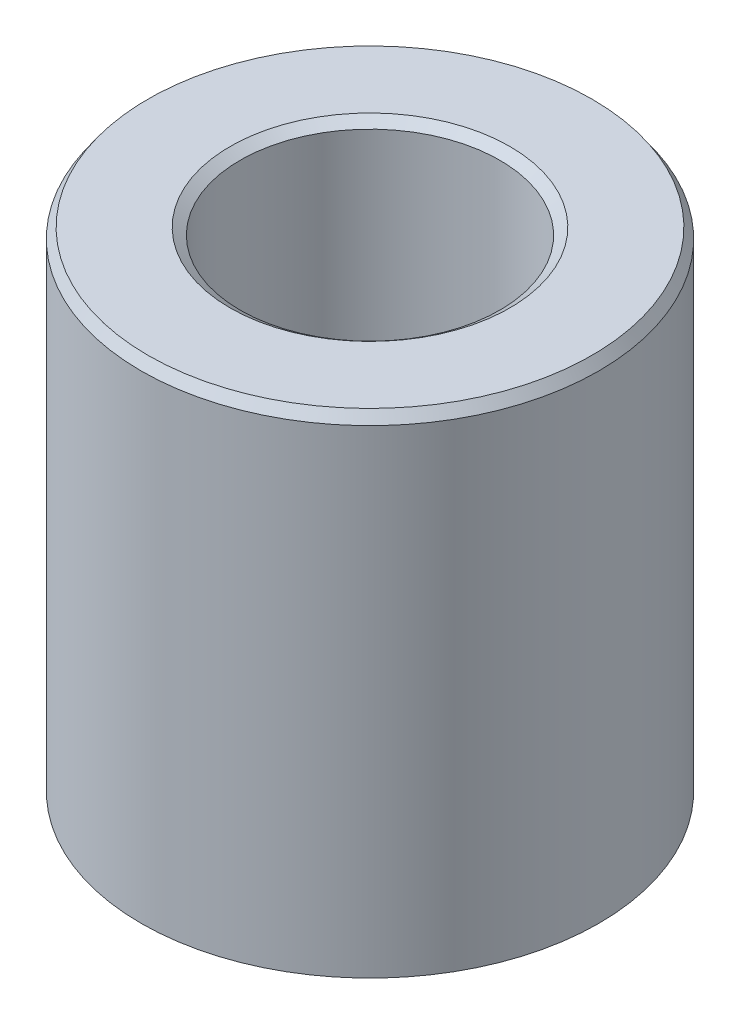
ISO-10303-21;
HEADER;
FILE_DESCRIPTION(('STEP AP214'),'2;1');
FILE_NAME('part.step','',(''),(''),'','','');
FILE_SCHEMA(('AUTOMOTIVE_DESIGN { 1 0 10303 214 1 1 1 1 }'));
ENDSEC;
DATA;
#1=APPLICATION_CONTEXT('core data for automotive mechanical design processes');
#2=APPLICATION_PROTOCOL_DEFINITION('international standard','automotive_design',2000,#1);
#3=PRODUCT_CONTEXT('',#1,'mechanical');
#4=PRODUCT('Part','Part','',(#3));
#5=PRODUCT_RELATED_PRODUCT_CATEGORY('part','',(#4));
#6=PRODUCT_DEFINITION_FORMATION('','',#4);
#7=PRODUCT_DEFINITION_CONTEXT('part definition',#1,'design');
#8=PRODUCT_DEFINITION('design','',#6,#7);
#9=PRODUCT_DEFINITION_SHAPE('','',#8);
#10=(LENGTH_UNIT() NAMED_UNIT(*) SI_UNIT(.MILLI.,.METRE.));
#11=(NAMED_UNIT(*) PLANE_ANGLE_UNIT() SI_UNIT($,.RADIAN.));
#12=(NAMED_UNIT(*) SI_UNIT($,.STERADIAN.) SOLID_ANGLE_UNIT());
#13=UNCERTAINTY_MEASURE_WITH_UNIT(LENGTH_MEASURE(1.E-05),#10,'distance_accuracy_value','');
#14=(GEOMETRIC_REPRESENTATION_CONTEXT(3) GLOBAL_UNCERTAINTY_ASSIGNED_CONTEXT((#13)) GLOBAL_UNIT_ASSIGNED_CONTEXT((#10,
#11,#12)) REPRESENTATION_CONTEXT('',''));
#15=CARTESIAN_POINT('',(0.,0.,0.));
#16=DIRECTION('',(0.,0.,1.));
#17=DIRECTION('',(1.,0.,0.));
#18=AXIS2_PLACEMENT_3D('',#15,#16,#17);
#19=CARTESIAN_POINT('',(0.,129.861566175015,0.));
#20=DIRECTION('',(0.,-1.,0.));
#21=DIRECTION('',(0.,0.,-1.));
#22=AXIS2_PLACEMENT_3D('',#19,#20,#21);
#23=CYLINDRICAL_SURFACE('',#22,60.);
#24=CARTESIAN_POINT('',(0.,1.81117595208058,0.));
#25=DIRECTION('',(0.,1.,0.));
#26=DIRECTION('',(0.,0.,1.));
#27=AXIS2_PLACEMENT_3D('',#24,#25,#26);
#28=CIRCLE('',#27,60.);
#29=CARTESIAN_POINT('',(0.,1.81117595208058,60.));
#30=VERTEX_POINT('',#29);
#31=EDGE_CURVE('E10',#30,#30,#28,.T.);
#32=ORIENTED_EDGE('',*,*,#31,.T.);
#33=EDGE_LOOP('',(#32));
#34=FACE_BOUND('',#33,.T.);
#35=CARTESIAN_POINT('',(0.,127.233057292651,0.));
#36=DIRECTION('',(0.,1.,0.));
#37=DIRECTION('',(0.,0.,1.));
#38=AXIS2_PLACEMENT_3D('',#35,#36,#37);
#39=CIRCLE('',#38,60.);
#40=CARTESIAN_POINT('',(0.,127.233057292651,60.));
#41=VERTEX_POINT('',#40);
#42=EDGE_CURVE('E50',#41,#41,#39,.F.);
#43=ORIENTED_EDGE('',*,*,#42,.T.);
#44=EDGE_LOOP('',(#43));
#45=FACE_BOUND('',#44,.T.);
#46=ADVANCED_FACE('F39',(#34,#45),#23,.T.);
#47=CARTESIAN_POINT('',(0.,129.861566175015,0.));
#48=DIRECTION('',(0.,1.,0.));
#49=DIRECTION('',(0.,0.,1.));
#50=AXIS2_PLACEMENT_3D('',#47,#48,#49);
#51=PLANE('',#50);
#52=CARTESIAN_POINT('',(0.,129.861566175015,0.));
#53=DIRECTION('',(0.,1.,0.));
#54=DIRECTION('',(0.,0.,1.));
#55=AXIS2_PLACEMENT_3D('',#52,#53,#54);
#56=CIRCLE('',#55,36.6722442143869);
#57=CARTESIAN_POINT('',(0.,129.861566175015,36.6722442143869));
#58=VERTEX_POINT('',#57);
#59=EDGE_CURVE('E58',#58,#58,#56,.F.);
#60=ORIENTED_EDGE('',*,*,#59,.T.);
#61=EDGE_LOOP('',(#60));
#62=FACE_BOUND('',#61,.T.);
#63=CARTESIAN_POINT('',(0.,129.861566175015,0.));
#64=DIRECTION('',(0.,1.,0.));
#65=DIRECTION('',(0.,0.,1.));
#66=AXIS2_PLACEMENT_3D('',#63,#64,#65);
#67=CIRCLE('',#66,58.1888240479194);
#68=CARTESIAN_POINT('',(0.,129.861566175015,58.1888240479194));
#69=VERTEX_POINT('',#68);
#70=EDGE_CURVE('E61',#69,#69,#67,.T.);
#71=ORIENTED_EDGE('',*,*,#70,.T.);
#72=EDGE_LOOP('',(#71));
#73=FACE_BOUND('',#72,.T.);
#74=ADVANCED_FACE('F88',(#62,#73),#51,.T.);
#75=CARTESIAN_POINT('',(0.,0.,0.));
#76=DIRECTION('',(0.,1.,0.));
#77=DIRECTION('',(0.,0.,1.));
#78=AXIS2_PLACEMENT_3D('',#75,#76,#77);
#79=PLANE('',#78);
#80=CARTESIAN_POINT('',(0.,0.,0.));
#81=DIRECTION('',(0.,1.,0.));
#82=DIRECTION('',(0.,0.,1.));
#83=AXIS2_PLACEMENT_3D('',#80,#81,#82);
#84=CIRCLE('',#83,35.8549112841044);
#85=CARTESIAN_POINT('',(0.,0.,35.8549112841044));
#86=VERTEX_POINT('',#85);
#87=EDGE_CURVE('E51',#86,#86,#84,.T.);
#88=ORIENTED_EDGE('',*,*,#87,.T.);
#89=EDGE_LOOP('',(#88));
#90=FACE_BOUND('',#89,.T.);
#91=CARTESIAN_POINT('',(0.,0.,0.));
#92=DIRECTION('',(0.,1.,0.));
#93=DIRECTION('',(0.,0.,1.));
#94=AXIS2_PLACEMENT_3D('',#91,#92,#93);
#95=CIRCLE('',#94,57.3714911176369);
#96=CARTESIAN_POINT('',(0.,0.,57.3714911176369));
#97=VERTEX_POINT('',#96);
#98=EDGE_CURVE('E54',#97,#97,#95,.F.);
#99=ORIENTED_EDGE('',*,*,#98,.T.);
#100=EDGE_LOOP('',(#99));
#101=FACE_BOUND('',#100,.T.);
#102=ADVANCED_FACE('F83',(#90,#101),#79,.F.);
#103=CARTESIAN_POINT('',(0.,129.861566175015,0.));
#104=DIRECTION('',(0.,-1.,0.));
#105=DIRECTION('',(0.,0.,-1.));
#106=AXIS2_PLACEMENT_3D('',#103,#104,#105);
#107=CYLINDRICAL_SURFACE('',#106,34.0437353320238);
#108=CARTESIAN_POINT('',(0.,128.050390222934,0.));
#109=DIRECTION('',(0.,1.,0.));
#110=DIRECTION('',(0.,0.,1.));
#111=AXIS2_PLACEMENT_3D('',#108,#109,#110);
#112=CIRCLE('',#111,34.0437353320238);
#113=CARTESIAN_POINT('',(0.,128.050390222934,34.0437353320238));
#114=VERTEX_POINT('',#113);
#115=EDGE_CURVE('E67',#114,#114,#112,.T.);
#116=ORIENTED_EDGE('',*,*,#115,.T.);
#117=EDGE_LOOP('',(#116));
#118=FACE_BOUND('',#117,.T.);
#119=CARTESIAN_POINT('',(0.,2.62850888236307,0.));
#120=DIRECTION('',(0.,1.,0.));
#121=DIRECTION('',(0.,0.,1.));
#122=AXIS2_PLACEMENT_3D('',#119,#120,#121);
#123=CIRCLE('',#122,34.0437353320238);
#124=CARTESIAN_POINT('',(0.,2.62850888236307,34.0437353320238));
#125=VERTEX_POINT('',#124);
#126=EDGE_CURVE('E69',#125,#125,#123,.F.);
#127=ORIENTED_EDGE('',*,*,#126,.T.);
#128=EDGE_LOOP('',(#127));
#129=FACE_BOUND('',#128,.T.);
#130=ADVANCED_FACE('F71',(#118,#129),#107,.F.);
#131=CARTESIAN_POINT('',(0.,128.050390222934,0.));
#132=DIRECTION('',(0.,1.,0.));
#133=DIRECTION('',(0.,0.,1.));
#134=AXIS2_PLACEMENT_3D('',#131,#132,#133);
#135=CONICAL_SURFACE('',#134,34.0437353320238,0.967456730356108);
#136=ORIENTED_EDGE('',*,*,#59,.F.);
#137=EDGE_LOOP('',(#136));
#138=FACE_BOUND('',#137,.T.);
#139=ORIENTED_EDGE('',*,*,#115,.F.);
#140=EDGE_LOOP('',(#139));
#141=FACE_BOUND('',#140,.T.);
#142=ADVANCED_FACE('F77',(#138,#141),#135,.F.);
#143=CARTESIAN_POINT('',(0.,0.,0.));
#144=DIRECTION('',(0.,-1.,0.));
#145=DIRECTION('',(0.,0.,-1.));
#146=AXIS2_PLACEMENT_3D('',#143,#144,#145);
#147=CONICAL_SURFACE('',#146,35.8549112841044,0.603339596438784);
#148=ORIENTED_EDGE('',*,*,#126,.F.);
#149=EDGE_LOOP('',(#148));
#150=FACE_BOUND('',#149,.T.);
#151=ORIENTED_EDGE('',*,*,#87,.F.);
#152=EDGE_LOOP('',(#151));
#153=FACE_BOUND('',#152,.T.);
#154=ADVANCED_FACE('F73',(#150,#153),#147,.F.);
#155=CARTESIAN_POINT('',(0.,1.81117595208058,0.));
#156=DIRECTION('',(0.,1.,0.));
#157=DIRECTION('',(0.,0.,1.));
#158=AXIS2_PLACEMENT_3D('',#155,#156,#157);
#159=CONICAL_SURFACE('',#158,60.,0.967456730356109);
#160=ORIENTED_EDGE('',*,*,#98,.F.);
#161=EDGE_LOOP('',(#160));
#162=FACE_BOUND('',#161,.T.);
#163=ORIENTED_EDGE('',*,*,#31,.F.);
#164=EDGE_LOOP('',(#163));
#165=FACE_BOUND('',#164,.T.);
#166=ADVANCED_FACE('F76',(#162,#165),#159,.T.);
#167=CARTESIAN_POINT('',(0.,129.861566175015,0.));
#168=DIRECTION('',(0.,-1.,0.));
#169=DIRECTION('',(0.,0.,-1.));
#170=AXIS2_PLACEMENT_3D('',#167,#168,#169);
#171=CONICAL_SURFACE('',#170,58.1888240479194,0.60333959643879);
#172=ORIENTED_EDGE('',*,*,#42,.F.);
#173=EDGE_LOOP('',(#172));
#174=FACE_BOUND('',#173,.T.);
#175=ORIENTED_EDGE('',*,*,#70,.F.);
#176=EDGE_LOOP('',(#175));
#177=FACE_BOUND('',#176,.T.);
#178=ADVANCED_FACE('F45',(#174,#177),#171,.T.);
#179=CLOSED_SHELL('',(#46,#74,#102,#130,#142,#154,#166,#178));
#180=MANIFOLD_SOLID_BREP('B2',#179);
#181=ADVANCED_BREP_SHAPE_REPRESENTATION('',(#18,#180),#14);
#182=SHAPE_DEFINITION_REPRESENTATION(#9,#181);
ENDSEC;
END-ISO-10303-21;
